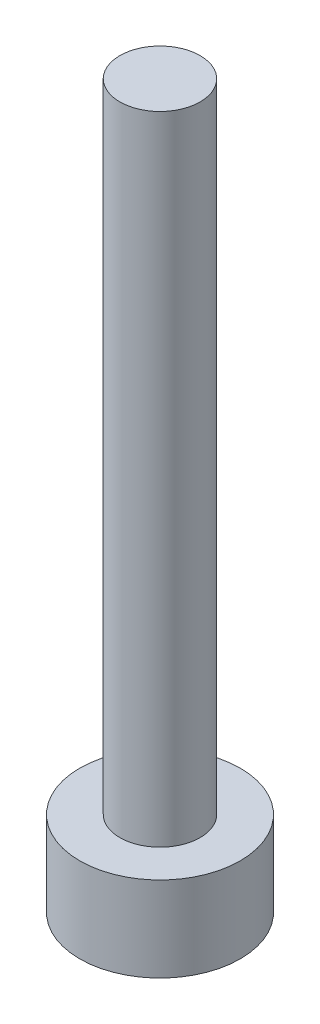
ISO-10303-21;
HEADER;
FILE_DESCRIPTION(('STEP AP214'),'2;1');
FILE_NAME('part.step','',(''),(''),'','','');
FILE_SCHEMA(('AUTOMOTIVE_DESIGN { 1 0 10303 214 1 1 1 1 }'));
ENDSEC;
DATA;
#1=APPLICATION_CONTEXT('core data for automotive mechanical design processes');
#2=APPLICATION_PROTOCOL_DEFINITION('international standard','automotive_design',2000,#1);
#3=PRODUCT_CONTEXT('',#1,'mechanical');
#4=PRODUCT('Part','Part','',(#3));
#5=PRODUCT_RELATED_PRODUCT_CATEGORY('part','',(#4));
#6=PRODUCT_DEFINITION_FORMATION('','',#4);
#7=PRODUCT_DEFINITION_CONTEXT('part definition',#1,'design');
#8=PRODUCT_DEFINITION('design','',#6,#7);
#9=PRODUCT_DEFINITION_SHAPE('','',#8);
#10=(LENGTH_UNIT() NAMED_UNIT(*) SI_UNIT(.MILLI.,.METRE.));
#11=(NAMED_UNIT(*) PLANE_ANGLE_UNIT() SI_UNIT($,.RADIAN.));
#12=(NAMED_UNIT(*) SI_UNIT($,.STERADIAN.) SOLID_ANGLE_UNIT());
#13=UNCERTAINTY_MEASURE_WITH_UNIT(LENGTH_MEASURE(1.E-05),#10,'distance_accuracy_value','');
#14=(GEOMETRIC_REPRESENTATION_CONTEXT(3) GLOBAL_UNCERTAINTY_ASSIGNED_CONTEXT((#13)) GLOBAL_UNIT_ASSIGNED_CONTEXT((#10,
#11,#12)) REPRESENTATION_CONTEXT('',''));
#15=CARTESIAN_POINT('',(0.,0.,0.));
#16=DIRECTION('',(0.,0.,1.));
#17=DIRECTION('',(1.,0.,0.));
#18=AXIS2_PLACEMENT_3D('',#15,#16,#17);
#19=CARTESIAN_POINT('',(0.,6.35,0.));
#20=DIRECTION('',(0.,-1.,0.));
#21=DIRECTION('',(0.,0.,-1.));
#22=AXIS2_PLACEMENT_3D('',#19,#20,#21);
#23=CYLINDRICAL_SURFACE('',#22,2.999994);
#24=CARTESIAN_POINT('',(0.,53.975,0.));
#25=DIRECTION('',(0.,-1.,0.));
#26=DIRECTION('',(0.,0.,-1.));
#27=AXIS2_PLACEMENT_3D('',#24,#25,#26);
#28=CIRCLE('',#27,2.999994);
#29=CARTESIAN_POINT('',(0.,53.975,-2.999994));
#30=VERTEX_POINT('',#29);
#31=EDGE_CURVE('E51',#30,#30,#28,.T.);
#32=ORIENTED_EDGE('',*,*,#31,.T.);
#33=EDGE_LOOP('',(#32));
#34=FACE_BOUND('',#33,.T.);
#35=CARTESIAN_POINT('',(0.,6.35,0.));
#36=DIRECTION('',(0.,-1.,0.));
#37=DIRECTION('',(0.,0.,-1.));
#38=AXIS2_PLACEMENT_3D('',#35,#36,#37);
#39=CIRCLE('',#38,2.999994);
#40=CARTESIAN_POINT('',(0.,6.35,-2.999994));
#41=VERTEX_POINT('',#40);
#42=EDGE_CURVE('E10',#41,#41,#39,.T.);
#43=ORIENTED_EDGE('',*,*,#42,.F.);
#44=EDGE_LOOP('',(#43));
#45=FACE_BOUND('',#44,.T.);
#46=ADVANCED_FACE('F37',(#34,#45),#23,.T.);
#47=CARTESIAN_POINT('',(0.,6.35,0.));
#48=DIRECTION('',(0.,-1.,0.));
#49=DIRECTION('',(0.,0.,-1.));
#50=AXIS2_PLACEMENT_3D('',#47,#48,#49);
#51=PLANE('',#50);
#52=CARTESIAN_POINT('',(0.,6.35,0.));
#53=DIRECTION('',(0.,-1.,0.));
#54=DIRECTION('',(0.,0.,-1.));
#55=AXIS2_PLACEMENT_3D('',#52,#53,#54);
#56=CIRCLE('',#55,6.);
#57=CARTESIAN_POINT('',(0.,6.35,-6.));
#58=VERTEX_POINT('',#57);
#59=EDGE_CURVE('E43',#58,#58,#56,.T.);
#60=ORIENTED_EDGE('',*,*,#59,.F.);
#61=EDGE_LOOP('',(#60));
#62=FACE_BOUND('',#61,.T.);
#63=ORIENTED_EDGE('',*,*,#42,.T.);
#64=EDGE_LOOP('',(#63));
#65=FACE_BOUND('',#64,.T.);
#66=ADVANCED_FACE('F70',(#62,#65),#51,.F.);
#67=CARTESIAN_POINT('',(0.,6.35,0.));
#68=DIRECTION('',(0.,-1.,0.));
#69=DIRECTION('',(0.,0.,-1.));
#70=AXIS2_PLACEMENT_3D('',#67,#68,#69);
#71=CYLINDRICAL_SURFACE('',#70,6.);
#72=ORIENTED_EDGE('',*,*,#59,.T.);
#73=EDGE_LOOP('',(#72));
#74=FACE_BOUND('',#73,.T.);
#75=CARTESIAN_POINT('',(0.,0.,0.));
#76=DIRECTION('',(0.,-1.,0.));
#77=DIRECTION('',(0.,0.,-1.));
#78=AXIS2_PLACEMENT_3D('',#75,#76,#77);
#79=CIRCLE('',#78,6.);
#80=CARTESIAN_POINT('',(0.,0.,-6.));
#81=VERTEX_POINT('',#80);
#82=EDGE_CURVE('E47',#81,#81,#79,.T.);
#83=ORIENTED_EDGE('',*,*,#82,.F.);
#84=EDGE_LOOP('',(#83));
#85=FACE_BOUND('',#84,.T.);
#86=ADVANCED_FACE('F66',(#74,#85),#71,.T.);
#87=CARTESIAN_POINT('',(0.,0.,0.));
#88=DIRECTION('',(0.,-1.,0.));
#89=DIRECTION('',(0.,0.,-1.));
#90=AXIS2_PLACEMENT_3D('',#87,#88,#89);
#91=PLANE('',#90);
#92=ORIENTED_EDGE('',*,*,#82,.T.);
#93=EDGE_LOOP('',(#92));
#94=FACE_BOUND('',#93,.T.);
#95=ADVANCED_FACE('F61',(#94),#91,.T.);
#96=CARTESIAN_POINT('',(0.,53.975,0.));
#97=DIRECTION('',(0.,-1.,0.));
#98=DIRECTION('',(0.,0.,-1.));
#99=AXIS2_PLACEMENT_3D('',#96,#97,#98);
#100=PLANE('',#99);
#101=ORIENTED_EDGE('',*,*,#31,.F.);
#102=EDGE_LOOP('',(#101));
#103=FACE_BOUND('',#102,.T.);
#104=ADVANCED_FACE('F59',(#103),#100,.F.);
#105=CLOSED_SHELL('',(#46,#66,#86,#95,#104));
#106=MANIFOLD_SOLID_BREP('B2',#105);
#107=ADVANCED_BREP_SHAPE_REPRESENTATION('',(#18,#106),#14);
#108=SHAPE_DEFINITION_REPRESENTATION(#9,#107);
ENDSEC;
END-ISO-10303-21;
